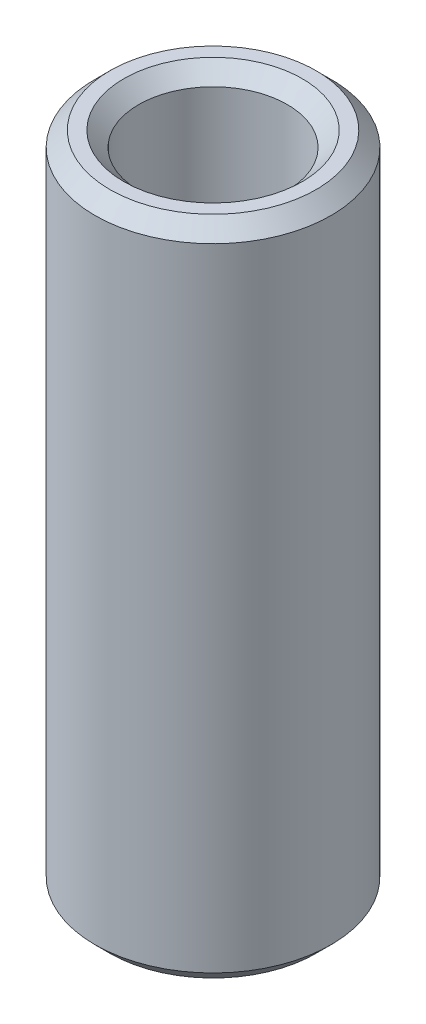
ISO-10303-21;
HEADER;
FILE_DESCRIPTION(('STEP AP214'),'2;1');
FILE_NAME('part.step','',(''),(''),'','','');
FILE_SCHEMA(('AUTOMOTIVE_DESIGN { 1 0 10303 214 1 1 1 1 }'));
ENDSEC;
DATA;
#1=APPLICATION_CONTEXT('core data for automotive mechanical design processes');
#2=APPLICATION_PROTOCOL_DEFINITION('international standard','automotive_design',2000,#1);
#3=PRODUCT_CONTEXT('',#1,'mechanical');
#4=PRODUCT('Part','Part','',(#3));
#5=PRODUCT_RELATED_PRODUCT_CATEGORY('part','',(#4));
#6=PRODUCT_DEFINITION_FORMATION('','',#4);
#7=PRODUCT_DEFINITION_CONTEXT('part definition',#1,'design');
#8=PRODUCT_DEFINITION('design','',#6,#7);
#9=PRODUCT_DEFINITION_SHAPE('','',#8);
#10=(LENGTH_UNIT() NAMED_UNIT(*) SI_UNIT(.MILLI.,.METRE.));
#11=(NAMED_UNIT(*) PLANE_ANGLE_UNIT() SI_UNIT($,.RADIAN.));
#12=(NAMED_UNIT(*) SI_UNIT($,.STERADIAN.) SOLID_ANGLE_UNIT());
#13=UNCERTAINTY_MEASURE_WITH_UNIT(LENGTH_MEASURE(1.E-05),#10,'distance_accuracy_value','');
#14=(GEOMETRIC_REPRESENTATION_CONTEXT(3) GLOBAL_UNCERTAINTY_ASSIGNED_CONTEXT((#13)) GLOBAL_UNIT_ASSIGNED_CONTEXT((#10,
#11,#12)) REPRESENTATION_CONTEXT('',''));
#15=CARTESIAN_POINT('',(0.,0.,0.));
#16=DIRECTION('',(0.,0.,1.));
#17=DIRECTION('',(1.,0.,0.));
#18=AXIS2_PLACEMENT_3D('',#15,#16,#17);
#19=CARTESIAN_POINT('',(0.,168.139825975028,0.));
#20=DIRECTION('',(0.,-1.,0.));
#21=DIRECTION('',(0.,0.,-1.));
#22=AXIS2_PLACEMENT_3D('',#19,#20,#21);
#23=CYLINDRICAL_SURFACE('',#22,30.);
#24=CARTESIAN_POINT('',(0.,3.79868335064248,0.));
#25=DIRECTION('',(0.,1.,0.));
#26=DIRECTION('',(0.,0.,1.));
#27=AXIS2_PLACEMENT_3D('',#24,#25,#26);
#28=CIRCLE('',#27,30.);
#29=CARTESIAN_POINT('',(0.,3.79868335064248,30.));
#30=VERTEX_POINT('',#29);
#31=EDGE_CURVE('E10',#30,#30,#28,.T.);
#32=ORIENTED_EDGE('',*,*,#31,.T.);
#33=EDGE_LOOP('',(#32));
#34=FACE_BOUND('',#33,.T.);
#35=CARTESIAN_POINT('',(0.,164.341142624385,0.));
#36=DIRECTION('',(0.,1.,0.));
#37=DIRECTION('',(0.,0.,1.));
#38=AXIS2_PLACEMENT_3D('',#35,#36,#37);
#39=CIRCLE('',#38,30.);
#40=CARTESIAN_POINT('',(0.,164.341142624385,30.));
#41=VERTEX_POINT('',#40);
#42=EDGE_CURVE('E50',#41,#41,#39,.F.);
#43=ORIENTED_EDGE('',*,*,#42,.T.);
#44=EDGE_LOOP('',(#43));
#45=FACE_BOUND('',#44,.T.);
#46=ADVANCED_FACE('F39',(#34,#45),#23,.T.);
#47=CARTESIAN_POINT('',(0.,168.139825975028,0.));
#48=DIRECTION('',(0.,1.,0.));
#49=DIRECTION('',(0.,0.,1.));
#50=AXIS2_PLACEMENT_3D('',#47,#48,#49);
#51=PLANE('',#50);
#52=CARTESIAN_POINT('',(0.,168.139825975028,0.));
#53=DIRECTION('',(0.,1.,0.));
#54=DIRECTION('',(0.,0.,1.));
#55=AXIS2_PLACEMENT_3D('',#52,#53,#54);
#56=CIRCLE('',#55,22.6873218623066);
#57=CARTESIAN_POINT('',(0.,168.139825975028,22.6873218623066));
#58=VERTEX_POINT('',#57);
#59=EDGE_CURVE('E58',#58,#58,#56,.F.);
#60=ORIENTED_EDGE('',*,*,#59,.T.);
#61=EDGE_LOOP('',(#60));
#62=FACE_BOUND('',#61,.T.);
#63=CARTESIAN_POINT('',(0.,168.139825975028,0.));
#64=DIRECTION('',(0.,1.,0.));
#65=DIRECTION('',(0.,0.,1.));
#66=AXIS2_PLACEMENT_3D('',#63,#64,#65);
#67=CIRCLE('',#66,26.2013166493575);
#68=CARTESIAN_POINT('',(0.,168.139825975028,26.2013166493575));
#69=VERTEX_POINT('',#68);
#70=EDGE_CURVE('E61',#69,#69,#67,.T.);
#71=ORIENTED_EDGE('',*,*,#70,.T.);
#72=EDGE_LOOP('',(#71));
#73=FACE_BOUND('',#72,.T.);
#74=ADVANCED_FACE('F88',(#62,#73),#51,.T.);
#75=CARTESIAN_POINT('',(0.,0.,0.));
#76=DIRECTION('',(0.,1.,0.));
#77=DIRECTION('',(0.,0.,1.));
#78=AXIS2_PLACEMENT_3D('',#75,#76,#77);
#79=PLANE('',#78);
#80=CARTESIAN_POINT('',(0.,0.,0.));
#81=DIRECTION('',(0.,1.,0.));
#82=DIRECTION('',(0.,0.,1.));
#83=AXIS2_PLACEMENT_3D('',#80,#81,#82);
#84=CIRCLE('',#83,22.6873218623066);
#85=CARTESIAN_POINT('',(0.,0.,22.6873218623066));
#86=VERTEX_POINT('',#85);
#87=EDGE_CURVE('E51',#86,#86,#84,.T.);
#88=ORIENTED_EDGE('',*,*,#87,.T.);
#89=EDGE_LOOP('',(#88));
#90=FACE_BOUND('',#89,.T.);
#91=CARTESIAN_POINT('',(0.,0.,0.));
#92=DIRECTION('',(0.,1.,0.));
#93=DIRECTION('',(0.,0.,1.));
#94=AXIS2_PLACEMENT_3D('',#91,#92,#93);
#95=CIRCLE('',#94,26.2013166493575);
#96=CARTESIAN_POINT('',(0.,0.,26.2013166493575));
#97=VERTEX_POINT('',#96);
#98=EDGE_CURVE('E54',#97,#97,#95,.F.);
#99=ORIENTED_EDGE('',*,*,#98,.T.);
#100=EDGE_LOOP('',(#99));
#101=FACE_BOUND('',#100,.T.);
#102=ADVANCED_FACE('F83',(#90,#101),#79,.F.);
#103=CARTESIAN_POINT('',(0.,168.139825975028,0.));
#104=DIRECTION('',(0.,-1.,0.));
#105=DIRECTION('',(0.,0.,-1.));
#106=AXIS2_PLACEMENT_3D('',#103,#104,#105);
#107=CYLINDRICAL_SURFACE('',#106,18.888638511664);
#108=CARTESIAN_POINT('',(0.,164.341142624385,0.));
#109=DIRECTION('',(0.,1.,0.));
#110=DIRECTION('',(0.,0.,1.));
#111=AXIS2_PLACEMENT_3D('',#108,#109,#110);
#112=CIRCLE('',#111,18.888638511664);
#113=CARTESIAN_POINT('',(0.,164.341142624385,18.888638511664));
#114=VERTEX_POINT('',#113);
#115=EDGE_CURVE('E67',#114,#114,#112,.T.);
#116=ORIENTED_EDGE('',*,*,#115,.T.);
#117=EDGE_LOOP('',(#116));
#118=FACE_BOUND('',#117,.T.);
#119=CARTESIAN_POINT('',(0.,3.79868335064257,0.));
#120=DIRECTION('',(0.,1.,0.));
#121=DIRECTION('',(0.,0.,1.));
#122=AXIS2_PLACEMENT_3D('',#119,#120,#121);
#123=CIRCLE('',#122,18.888638511664);
#124=CARTESIAN_POINT('',(0.,3.79868335064257,18.888638511664));
#125=VERTEX_POINT('',#124);
#126=EDGE_CURVE('E69',#125,#125,#123,.F.);
#127=ORIENTED_EDGE('',*,*,#126,.T.);
#128=EDGE_LOOP('',(#127));
#129=FACE_BOUND('',#128,.T.);
#130=ADVANCED_FACE('F71',(#118,#129),#107,.F.);
#131=CARTESIAN_POINT('',(0.,164.341142624385,0.));
#132=DIRECTION('',(0.,1.,0.));
#133=DIRECTION('',(0.,0.,1.));
#134=AXIS2_PLACEMENT_3D('',#131,#132,#133);
#135=CONICAL_SURFACE('',#134,18.888638511664,0.78539816339745);
#136=ORIENTED_EDGE('',*,*,#59,.F.);
#137=EDGE_LOOP('',(#136));
#138=FACE_BOUND('',#137,.T.);
#139=ORIENTED_EDGE('',*,*,#115,.F.);
#140=EDGE_LOOP('',(#139));
#141=FACE_BOUND('',#140,.T.);
#142=ADVANCED_FACE('F77',(#138,#141),#135,.F.);
#143=CARTESIAN_POINT('',(0.,0.,0.));
#144=DIRECTION('',(0.,-1.,0.));
#145=DIRECTION('',(0.,0.,-1.));
#146=AXIS2_PLACEMENT_3D('',#143,#144,#145);
#147=CONICAL_SURFACE('',#146,22.6873218623066,0.785398163397443);
#148=ORIENTED_EDGE('',*,*,#126,.F.);
#149=EDGE_LOOP('',(#148));
#150=FACE_BOUND('',#149,.T.);
#151=ORIENTED_EDGE('',*,*,#87,.F.);
#152=EDGE_LOOP('',(#151));
#153=FACE_BOUND('',#152,.T.);
#154=ADVANCED_FACE('F73',(#150,#153),#147,.F.);
#155=CARTESIAN_POINT('',(0.,3.79868335064248,0.));
#156=DIRECTION('',(0.,1.,0.));
#157=DIRECTION('',(0.,0.,1.));
#158=AXIS2_PLACEMENT_3D('',#155,#156,#157);
#159=CONICAL_SURFACE('',#158,30.,0.785398163397452);
#160=CARTESIAN_POINT('',(0.,0.,26.2013166493575));
#161=CARTESIAN_POINT('',(0.,0.0395696182358588,26.2408862675933));
#162=CARTESIAN_POINT('',(0.,0.079139236471718,26.2804558858292));
#163=CARTESIAN_POINT('',(0.,0.158278472943436,26.3595951223009));
#164=CARTESIAN_POINT('',(0.,0.197848091179296,26.3991647405368));
#165=CARTESIAN_POINT('',(0.,0.276987327651014,26.4783039770085));
#166=CARTESIAN_POINT('',(0.,0.316556945886874,26.5178735952444));
#167=CARTESIAN_POINT('',(0.,0.395696182358592,26.5970128317161));
#168=CARTESIAN_POINT('',(0.,0.435265800594451,26.6365824499519));
#169=CARTESIAN_POINT('',(0.,0.514405037066169,26.7157216864237));
#170=CARTESIAN_POINT('',(0.,0.553974655302028,26.7552913046595));
#171=CARTESIAN_POINT('',(0.,0.633113891773747,26.8344305411312));
#172=CARTESIAN_POINT('',(0.,0.672683510009607,26.8740001593671));
#173=CARTESIAN_POINT('',(0.,0.751822746481325,26.9531393958388));
#174=CARTESIAN_POINT('',(0.,0.791392364717184,26.9927090140747));
#175=CARTESIAN_POINT('',(0.,0.870531601188902,27.0718482505464));
#176=CARTESIAN_POINT('',(0.,0.910101219424761,27.1114178687823));
#177=CARTESIAN_POINT('',(0.,0.98924045589648,27.190557105254));
#178=CARTESIAN_POINT('',(0.,1.02881007413234,27.2301267234898));
#179=CARTESIAN_POINT('',(0.,1.10794931060406,27.3092659599616));
#180=CARTESIAN_POINT('',(0.,1.14751892883992,27.3488355781974));
#181=CARTESIAN_POINT('',(0.,1.22665816531164,27.4279748146691));
#182=CARTESIAN_POINT('',(0.,1.26622778354749,27.467544432905));
#183=CARTESIAN_POINT('',(0.,1.34536702001921,27.5466836693767));
#184=CARTESIAN_POINT('',(0.,1.38493663825507,27.5862532876126));
#185=CARTESIAN_POINT('',(0.,1.46407587472679,27.6653925240843));
#186=CARTESIAN_POINT('',(0.,1.50364549296265,27.7049621423201));
#187=CARTESIAN_POINT('',(0.,1.58278472943437,27.7841013787919));
#188=CARTESIAN_POINT('',(0.,1.62235434767023,27.8236709970277));
#189=CARTESIAN_POINT('',(0.,1.70149358414195,27.9028102334994));
#190=CARTESIAN_POINT('',(0.,1.74106320237781,27.9423798517353));
#191=CARTESIAN_POINT('',(0.,1.82020243884952,28.021519088207));
#192=CARTESIAN_POINT('',(0.,1.85977205708538,28.0610887064429));
#193=CARTESIAN_POINT('',(0.,1.9389112935571,28.1402279429146));
#194=CARTESIAN_POINT('',(0.,1.97848091179296,28.1797975611505));
#195=CARTESIAN_POINT('',(0.,2.05762014826468,28.2589367976222));
#196=CARTESIAN_POINT('',(0.,2.09718976650054,28.298506415858));
#197=CARTESIAN_POINT('',(0.,2.17632900297226,28.3776456523298));
#198=CARTESIAN_POINT('',(0.,2.21589862120812,28.4172152705656));
#199=CARTESIAN_POINT('',(0.,2.29503785767983,28.4963545070373));
#200=CARTESIAN_POINT('',(0.,2.33460747591569,28.5359241252732));
#201=CARTESIAN_POINT('',(0.,2.41374671238741,28.6150633617449));
#202=CARTESIAN_POINT('',(0.,2.45331633062327,28.6546329799808));
#203=CARTESIAN_POINT('',(0.,2.53245556709499,28.7337722164525));
#204=CARTESIAN_POINT('',(0.,2.57202518533085,28.7733418346884));
#205=CARTESIAN_POINT('',(0.,2.65116442180257,28.8524810711601));
#206=CARTESIAN_POINT('',(0.,2.69073404003843,28.8920506893959));
#207=CARTESIAN_POINT('',(0.,2.76987327651014,28.9711899258677));
#208=CARTESIAN_POINT('',(0.,2.809442894746,29.0107595441035));
#209=CARTESIAN_POINT('',(0.,2.88858213121772,29.0898987805752));
#210=CARTESIAN_POINT('',(0.,2.92815174945358,29.1294683988111));
#211=CARTESIAN_POINT('',(0.,3.0072909859253,29.2086076352828));
#212=CARTESIAN_POINT('',(0.,3.04686060416116,29.2481772535187));
#213=CARTESIAN_POINT('',(0.,3.12599984063288,29.3273164899904));
#214=CARTESIAN_POINT('',(0.,3.16556945886874,29.3668861082262));
#215=CARTESIAN_POINT('',(0.,3.24470869534046,29.446025344698));
#216=CARTESIAN_POINT('',(0.,3.28427831357631,29.4855949629338));
#217=CARTESIAN_POINT('',(0.,3.36341755004803,29.5647341994055));
#218=CARTESIAN_POINT('',(0.,3.40298716828389,29.6043038176414));
#219=CARTESIAN_POINT('',(0.,3.48212640475561,29.6834430541131));
#220=CARTESIAN_POINT('',(0.,3.52169602299147,29.723012672349));
#221=CARTESIAN_POINT('',(0.,3.60083525946319,29.8021519088207));
#222=CARTESIAN_POINT('',(0.,3.64040487769905,29.8417215270566));
#223=CARTESIAN_POINT('',(0.,3.71954411417077,29.9208607635283));
#224=CARTESIAN_POINT('',(0.,3.75911373240663,29.9604303817641));
#225=CARTESIAN_POINT('',(0.,3.79868335064248,30.));
#226=B_SPLINE_CURVE_WITH_KNOTS('',3,(#160,#161,#162,#163,#164,#165,#166,#167,#168,#169,#170,
#171,#172,#173,#174,#175,#176,#177,#178,#179,#180,#181,#182,#183,#184,#185,#186,#187,#188,#189,
#190,#191,#192,#193,#194,#195,#196,#197,#198,#199,#200,#201,#202,#203,#204,#205,#206,#207,#208,
#209,#210,#211,#212,#213,#214,#215,#216,#217,#218,#219,#220,#221,#222,#223,#224,#225),
.UNSPECIFIED.,.F.,.F.,(4,2,2,2,2,2,2,2,2,2,2,2,2,2,2,2,2,2,2,2,2,2,2,2,2,2,2,2,2,2,2,2,4),(0.,
0.167879672301234,0.335759344602467,0.503639016903701,0.671518689204937,0.83939836150617,
1.0072780338074,1.17515770610864,1.34303737840987,1.51091705071111,1.67879672301234,
1.84667639531357,2.01455606761481,2.18243573991604,2.35031541221728,2.51819508451851,
2.68607475681975,2.85395442912098,3.02183410142221,3.18971377372345,3.35759344602468,
3.52547311832592,3.69335279062715,3.86123246292839,4.02911213522962,4.19699180753085,
4.36487147983209,4.53275115213332,4.70063082443456,4.86851049673579,5.03639016903703,
5.20426984133826,5.37214951363949),.UNSPECIFIED.);
#227=EDGE_CURVE('BSEAM76',#97,#30,#226,.T.);
#228=ORIENTED_EDGE('',*,*,#98,.F.);
#229=ORIENTED_EDGE('',*,*,#31,.F.);
#230=ORIENTED_EDGE('',*,*,#227,.T.);
#231=ORIENTED_EDGE('',*,*,#227,.F.);
#232=EDGE_LOOP('',(#228,#230,#229,#231));
#233=FACE_BOUND('',#232,.T.);
#234=ADVANCED_FACE('F76',(#233),#159,.T.);
#235=CARTESIAN_POINT('',(0.,168.139825975028,0.));
#236=DIRECTION('',(0.,-1.,0.));
#237=DIRECTION('',(0.,0.,-1.));
#238=AXIS2_PLACEMENT_3D('',#235,#236,#237);
#239=CONICAL_SURFACE('',#238,26.2013166493575,0.785398163397441);
#240=ORIENTED_EDGE('',*,*,#42,.F.);
#241=EDGE_LOOP('',(#240));
#242=FACE_BOUND('',#241,.T.);
#243=ORIENTED_EDGE('',*,*,#70,.F.);
#244=EDGE_LOOP('',(#243));
#245=FACE_BOUND('',#244,.T.);
#246=ADVANCED_FACE('F45',(#242,#245),#239,.T.);
#247=CLOSED_SHELL('',(#46,#74,#102,#130,#142,#154,#234,#246));
#248=MANIFOLD_SOLID_BREP('B2',#247);
#249=ADVANCED_BREP_SHAPE_REPRESENTATION('',(#18,#248),#14);
#250=SHAPE_DEFINITION_REPRESENTATION(#9,#249);
ENDSEC;
END-ISO-10303-21;
